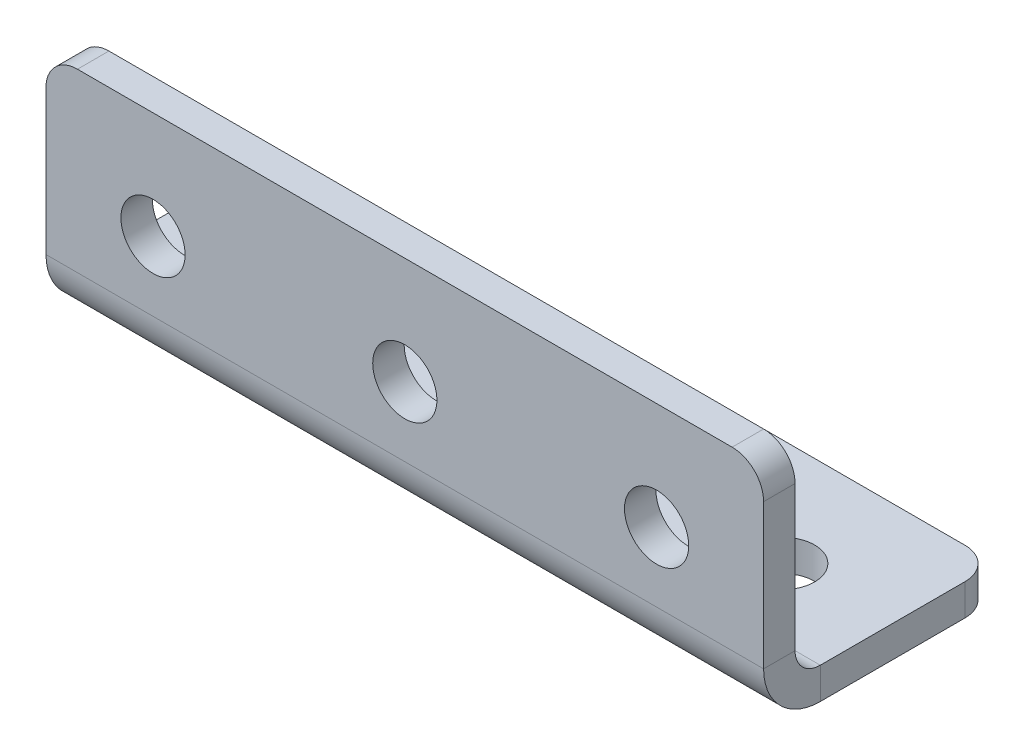
ISO-10303-21;
HEADER;
FILE_DESCRIPTION(('STEP AP214'),'2;1');
FILE_NAME('part.step','',(''),(''),'','','');
FILE_SCHEMA(('AUTOMOTIVE_DESIGN { 1 0 10303 214 1 1 1 1 }'));
ENDSEC;
DATA;
#1=APPLICATION_CONTEXT('core data for automotive mechanical design processes');
#2=APPLICATION_PROTOCOL_DEFINITION('international standard','automotive_design',2000,#1);
#3=PRODUCT_CONTEXT('',#1,'mechanical');
#4=PRODUCT('Part','Part','',(#3));
#5=PRODUCT_RELATED_PRODUCT_CATEGORY('part','',(#4));
#6=PRODUCT_DEFINITION_FORMATION('','',#4);
#7=PRODUCT_DEFINITION_CONTEXT('part definition',#1,'design');
#8=PRODUCT_DEFINITION('design','',#6,#7);
#9=PRODUCT_DEFINITION_SHAPE('','',#8);
#10=(LENGTH_UNIT() NAMED_UNIT(*) SI_UNIT(.MILLI.,.METRE.));
#11=(NAMED_UNIT(*) PLANE_ANGLE_UNIT() SI_UNIT($,.RADIAN.));
#12=(NAMED_UNIT(*) SI_UNIT($,.STERADIAN.) SOLID_ANGLE_UNIT());
#13=UNCERTAINTY_MEASURE_WITH_UNIT(LENGTH_MEASURE(1.E-05),#10,'distance_accuracy_value','');
#14=(GEOMETRIC_REPRESENTATION_CONTEXT(3) GLOBAL_UNCERTAINTY_ASSIGNED_CONTEXT((#13)) GLOBAL_UNIT_ASSIGNED_CONTEXT((#10,
#11,#12)) REPRESENTATION_CONTEXT('',''));
#15=CARTESIAN_POINT('',(0.,0.,0.));
#16=DIRECTION('',(0.,0.,1.));
#17=DIRECTION('',(1.,0.,0.));
#18=AXIS2_PLACEMENT_3D('',#15,#16,#17);
#19=CARTESIAN_POINT('',(57.,4.5,0.));
#20=DIRECTION('',(1.,0.,0.));
#21=DIRECTION('',(0.,0.,-1.));
#22=AXIS2_PLACEMENT_3D('',#19,#20,#21);
#23=PLANE('',#22);
#24=DIRECTION('',(0.,0.,-1.));
#25=VECTOR('',#24,1.);
#26=CARTESIAN_POINT('',(57.,4.5,0.));
#27=LINE('',#26,#25);
#28=CARTESIAN_POINT('',(57.,4.5,0.));
#29=VERTEX_POINT('',#28);
#30=CARTESIAN_POINT('',(57.,4.5,-2.5));
#31=VERTEX_POINT('',#30);
#32=EDGE_CURVE('E117',#29,#31,#27,.T.);
#33=ORIENTED_EDGE('',*,*,#32,.F.);
#34=CARTESIAN_POINT('',(57.,4.5,-4.5));
#35=DIRECTION('',(-1.,0.,0.));
#36=DIRECTION('',(0.,0.,1.));
#37=AXIS2_PLACEMENT_3D('',#34,#35,#36);
#38=CIRCLE('',#37,4.5);
#39=CARTESIAN_POINT('',(57.,0.,-4.5));
#40=VERTEX_POINT('',#39);
#41=EDGE_CURVE('E115',#29,#40,#38,.F.);
#42=ORIENTED_EDGE('',*,*,#41,.T.);
#43=DIRECTION('',(0.,-1.,0.));
#44=VECTOR('',#43,1.);
#45=CARTESIAN_POINT('',(57.,2.5,-4.5));
#46=LINE('',#45,#44);
#47=CARTESIAN_POINT('',(57.,2.5,-4.5));
#48=VERTEX_POINT('',#47);
#49=EDGE_CURVE('E109',#48,#40,#46,.T.);
#50=ORIENTED_EDGE('',*,*,#49,.F.);
#51=CARTESIAN_POINT('',(57.,4.5,-4.5));
#52=DIRECTION('',(1.,0.,0.));
#53=DIRECTION('',(0.,0.,-1.));
#54=AXIS2_PLACEMENT_3D('',#51,#52,#53);
#55=CIRCLE('',#54,2.);
#56=EDGE_CURVE('E113',#31,#48,#55,.T.);
#57=ORIENTED_EDGE('',*,*,#56,.F.);
#58=EDGE_LOOP('',(#33,#42,#50,#57));
#59=FACE_BOUND('',#58,.T.);
#60=ADVANCED_FACE('F16',(#59),#23,.T.);
#61=CARTESIAN_POINT('',(57.,2.5,-4.5));
#62=DIRECTION('',(1.,0.,0.));
#63=DIRECTION('',(0.,0.,-1.));
#64=AXIS2_PLACEMENT_3D('',#61,#62,#63);
#65=PLANE('',#64);
#66=DIRECTION('',(0.,1.,0.));
#67=VECTOR('',#66,1.);
#68=CARTESIAN_POINT('',(57.,0.,-2.5));
#69=LINE('',#68,#67);
#70=CARTESIAN_POINT('',(57.,16.,-2.5));
#71=VERTEX_POINT('',#70);
#72=EDGE_CURVE('E141',#71,#31,#69,.F.);
#73=ORIENTED_EDGE('',*,*,#72,.F.);
#74=DIRECTION('',(0.,0.,-1.));
#75=VECTOR('',#74,1.);
#76=CARTESIAN_POINT('',(57.,16.,-4.5));
#77=LINE('',#76,#75);
#78=CARTESIAN_POINT('',(57.,16.,0.));
#79=VERTEX_POINT('',#78);
#80=EDGE_CURVE('E194',#71,#79,#77,.F.);
#81=ORIENTED_EDGE('',*,*,#80,.T.);
#82=DIRECTION('',(0.,-1.,0.));
#83=VECTOR('',#82,1.);
#84=CARTESIAN_POINT('',(57.,0.,0.));
#85=LINE('',#84,#83);
#86=EDGE_CURVE('E143',#79,#29,#85,.T.);
#87=ORIENTED_EDGE('',*,*,#86,.T.);
#88=ORIENTED_EDGE('',*,*,#32,.T.);
#89=EDGE_LOOP('',(#73,#81,#87,#88));
#90=FACE_BOUND('',#89,.T.);
#91=ADVANCED_FACE('F245',(#90),#65,.T.);
#92=CARTESIAN_POINT('',(0.,0.,-4.5));
#93=DIRECTION('',(-1.,0.,0.));
#94=DIRECTION('',(0.,0.,1.));
#95=AXIS2_PLACEMENT_3D('',#92,#93,#94);
#96=PLANE('',#95);
#97=DIRECTION('',(0.,1.,0.));
#98=VECTOR('',#97,1.);
#99=CARTESIAN_POINT('',(0.,0.,-4.5));
#100=LINE('',#99,#98);
#101=CARTESIAN_POINT('',(0.,0.,-4.5));
#102=VERTEX_POINT('',#101);
#103=CARTESIAN_POINT('',(0.,2.5,-4.5));
#104=VERTEX_POINT('',#103);
#105=EDGE_CURVE('E118',#102,#104,#100,.T.);
#106=ORIENTED_EDGE('',*,*,#105,.F.);
#107=CARTESIAN_POINT('',(0.,4.5,-4.5));
#108=DIRECTION('',(-1.,0.,0.));
#109=DIRECTION('',(0.,0.,1.));
#110=AXIS2_PLACEMENT_3D('',#107,#108,#109);
#111=CIRCLE('',#110,4.5);
#112=CARTESIAN_POINT('',(0.,4.5,0.));
#113=VERTEX_POINT('',#112);
#114=EDGE_CURVE('E161',#113,#102,#111,.F.);
#115=ORIENTED_EDGE('',*,*,#114,.F.);
#116=DIRECTION('',(0.,0.,1.));
#117=VECTOR('',#116,1.);
#118=CARTESIAN_POINT('',(0.,4.5,-2.5));
#119=LINE('',#118,#117);
#120=CARTESIAN_POINT('',(0.,4.5,-2.5));
#121=VERTEX_POINT('',#120);
#122=EDGE_CURVE('E179',#121,#113,#119,.T.);
#123=ORIENTED_EDGE('',*,*,#122,.F.);
#124=CARTESIAN_POINT('',(0.,4.5,-4.5));
#125=DIRECTION('',(1.,0.,0.));
#126=DIRECTION('',(0.,0.,-1.));
#127=AXIS2_PLACEMENT_3D('',#124,#125,#126);
#128=CIRCLE('',#127,2.);
#129=EDGE_CURVE('E155',#121,#104,#128,.T.);
#130=ORIENTED_EDGE('',*,*,#129,.T.);
#131=EDGE_LOOP('',(#106,#115,#123,#130));
#132=FACE_BOUND('',#131,.T.);
#133=ADVANCED_FACE('F250',(#132),#96,.T.);
#134=CARTESIAN_POINT('',(0.,4.5,-2.5));
#135=DIRECTION('',(-1.,0.,0.));
#136=DIRECTION('',(0.,0.,1.));
#137=AXIS2_PLACEMENT_3D('',#134,#135,#136);
#138=PLANE('',#137);
#139=DIRECTION('',(0.,0.,-1.));
#140=VECTOR('',#139,1.);
#141=CARTESIAN_POINT('',(0.,2.5,0.));
#142=LINE('',#141,#140);
#143=CARTESIAN_POINT('',(0.,2.5,-16.));
#144=VERTEX_POINT('',#143);
#145=EDGE_CURVE('E128',#104,#144,#142,.T.);
#146=ORIENTED_EDGE('',*,*,#145,.T.);
#147=DIRECTION('',(0.,-1.,0.));
#148=VECTOR('',#147,1.);
#149=CARTESIAN_POINT('',(0.,4.5,-16.));
#150=LINE('',#149,#148);
#151=CARTESIAN_POINT('',(0.,0.,-16.));
#152=VERTEX_POINT('',#151);
#153=EDGE_CURVE('E203',#144,#152,#150,.T.);
#154=ORIENTED_EDGE('',*,*,#153,.T.);
#155=DIRECTION('',(0.,0.,-1.));
#156=VECTOR('',#155,1.);
#157=CARTESIAN_POINT('',(0.,0.,0.));
#158=LINE('',#157,#156);
#159=EDGE_CURVE('E150',#102,#152,#158,.T.);
#160=ORIENTED_EDGE('',*,*,#159,.F.);
#161=ORIENTED_EDGE('',*,*,#105,.T.);
#162=EDGE_LOOP('',(#146,#154,#160,#161));
#163=FACE_BOUND('',#162,.T.);
#164=ADVANCED_FACE('F285',(#163),#138,.T.);
#165=CARTESIAN_POINT('',(57.,0.,0.));
#166=DIRECTION('',(0.,1.,0.));
#167=DIRECTION('',(0.,0.,1.));
#168=AXIS2_PLACEMENT_3D('',#165,#166,#167);
#169=PLANE('',#168);
#170=CARTESIAN_POINT('',(48.5,0.,-10.));
#171=DIRECTION('',(0.,1.,0.));
#172=DIRECTION('',(0.,0.,1.));
#173=AXIS2_PLACEMENT_3D('',#170,#171,#172);
#174=CIRCLE('',#173,2.55);
#175=CARTESIAN_POINT('',(48.5,0.,-7.45));
#176=VERTEX_POINT('',#175);
#177=EDGE_CURVE('E314',#176,#176,#174,.T.);
#178=ORIENTED_EDGE('',*,*,#177,.T.);
#179=EDGE_LOOP('',(#178));
#180=FACE_BOUND('',#179,.T.);
#181=CARTESIAN_POINT('',(28.5,0.,-10.));
#182=DIRECTION('',(0.,1.,0.));
#183=DIRECTION('',(0.,0.,1.));
#184=AXIS2_PLACEMENT_3D('',#181,#182,#183);
#185=CIRCLE('',#184,2.55);
#186=CARTESIAN_POINT('',(28.5,0.,-7.45));
#187=VERTEX_POINT('',#186);
#188=EDGE_CURVE('E310',#187,#187,#185,.T.);
#189=ORIENTED_EDGE('',*,*,#188,.T.);
#190=EDGE_LOOP('',(#189));
#191=FACE_BOUND('',#190,.T.);
#192=CARTESIAN_POINT('',(8.5,0.,-10.));
#193=DIRECTION('',(0.,1.,0.));
#194=DIRECTION('',(0.,0.,1.));
#195=AXIS2_PLACEMENT_3D('',#192,#193,#194);
#196=CIRCLE('',#195,2.55);
#197=CARTESIAN_POINT('',(8.5,0.,-7.45));
#198=VERTEX_POINT('',#197);
#199=EDGE_CURVE('E296',#198,#198,#196,.T.);
#200=ORIENTED_EDGE('',*,*,#199,.T.);
#201=EDGE_LOOP('',(#200));
#202=FACE_BOUND('',#201,.T.);
#203=ORIENTED_EDGE('',*,*,#159,.T.);
#204=CARTESIAN_POINT('',(2.5,0.,-16.));
#205=DIRECTION('',(0.,1.,0.));
#206=DIRECTION('',(0.,0.,1.));
#207=AXIS2_PLACEMENT_3D('',#204,#205,#206);
#208=CIRCLE('',#207,2.5);
#209=CARTESIAN_POINT('',(2.50000000000002,0.,-18.5));
#210=VERTEX_POINT('',#209);
#211=EDGE_CURVE('E208',#152,#210,#208,.F.);
#212=ORIENTED_EDGE('',*,*,#211,.T.);
#213=DIRECTION('',(-1.,0.,0.));
#214=VECTOR('',#213,1.);
#215=CARTESIAN_POINT('',(57.,0.,-18.5));
#216=LINE('',#215,#214);
#217=CARTESIAN_POINT('',(54.5,0.,-18.5));
#218=VERTEX_POINT('',#217);
#219=EDGE_CURVE('E177',#218,#210,#216,.T.);
#220=ORIENTED_EDGE('',*,*,#219,.F.);
#221=CARTESIAN_POINT('',(54.5,0.,-16.));
#222=DIRECTION('',(0.,1.,0.));
#223=DIRECTION('',(0.,0.,1.));
#224=AXIS2_PLACEMENT_3D('',#221,#222,#223);
#225=CIRCLE('',#224,2.5);
#226=CARTESIAN_POINT('',(57.,0.,-16.));
#227=VERTEX_POINT('',#226);
#228=EDGE_CURVE('E206',#218,#227,#225,.F.);
#229=ORIENTED_EDGE('',*,*,#228,.T.);
#230=DIRECTION('',(0.,0.,-1.));
#231=VECTOR('',#230,1.);
#232=CARTESIAN_POINT('',(57.,0.,0.));
#233=LINE('',#232,#231);
#234=EDGE_CURVE('E136',#40,#227,#233,.T.);
#235=ORIENTED_EDGE('',*,*,#234,.F.);
#236=DIRECTION('',(-1.,0.,0.));
#237=VECTOR('',#236,1.);
#238=CARTESIAN_POINT('',(57.,0.,-4.5));
#239=LINE('',#238,#237);
#240=EDGE_CURVE('E149',#40,#102,#239,.T.);
#241=ORIENTED_EDGE('',*,*,#240,.T.);
#242=EDGE_LOOP('',(#203,#212,#220,#229,#235,#241));
#243=FACE_BOUND('',#242,.T.);
#244=ADVANCED_FACE('F280',(#180,#191,#202,#243),#169,.F.);
#245=CARTESIAN_POINT('',(57.,2.5,-18.5));
#246=DIRECTION('',(0.,0.,-1.));
#247=DIRECTION('',(-1.,0.,0.));
#248=AXIS2_PLACEMENT_3D('',#245,#246,#247);
#249=PLANE('',#248);
#250=ORIENTED_EDGE('',*,*,#219,.T.);
#251=DIRECTION('',(0.,-1.,0.));
#252=VECTOR('',#251,1.);
#253=CARTESIAN_POINT('',(2.5,2.5,-18.5));
#254=LINE('',#253,#252);
#255=CARTESIAN_POINT('',(2.50000000000002,2.5,-18.5));
#256=VERTEX_POINT('',#255);
#257=EDGE_CURVE('E39',#210,#256,#254,.F.);
#258=ORIENTED_EDGE('',*,*,#257,.T.);
#259=DIRECTION('',(-1.,0.,0.));
#260=VECTOR('',#259,1.);
#261=CARTESIAN_POINT('',(57.,2.5,-18.5));
#262=LINE('',#261,#260);
#263=CARTESIAN_POINT('',(54.5,2.5,-18.5));
#264=VERTEX_POINT('',#263);
#265=EDGE_CURVE('E132',#264,#256,#262,.T.);
#266=ORIENTED_EDGE('',*,*,#265,.F.);
#267=DIRECTION('',(0.,-1.,0.));
#268=VECTOR('',#267,1.);
#269=CARTESIAN_POINT('',(54.5,2.5,-18.5));
#270=LINE('',#269,#268);
#271=EDGE_CURVE('E210',#264,#218,#270,.T.);
#272=ORIENTED_EDGE('',*,*,#271,.T.);
#273=EDGE_LOOP('',(#250,#258,#266,#272));
#274=FACE_BOUND('',#273,.T.);
#275=ADVANCED_FACE('F277',(#274),#249,.T.);
#276=CARTESIAN_POINT('',(57.,2.5,0.));
#277=DIRECTION('',(0.,1.,0.));
#278=DIRECTION('',(0.,0.,1.));
#279=AXIS2_PLACEMENT_3D('',#276,#277,#278);
#280=PLANE('',#279);
#281=CARTESIAN_POINT('',(48.5,2.5,-10.));
#282=DIRECTION('',(0.,1.,0.));
#283=DIRECTION('',(0.,0.,1.));
#284=AXIS2_PLACEMENT_3D('',#281,#282,#283);
#285=CIRCLE('',#284,2.55);
#286=CARTESIAN_POINT('',(48.5,2.5,-7.45));
#287=VERTEX_POINT('',#286);
#288=EDGE_CURVE('E317',#287,#287,#285,.T.);
#289=ORIENTED_EDGE('',*,*,#288,.F.);
#290=EDGE_LOOP('',(#289));
#291=FACE_BOUND('',#290,.T.);
#292=CARTESIAN_POINT('',(28.5,2.5,-10.));
#293=DIRECTION('',(0.,1.,0.));
#294=DIRECTION('',(0.,0.,1.));
#295=AXIS2_PLACEMENT_3D('',#292,#293,#294);
#296=CIRCLE('',#295,2.55);
#297=CARTESIAN_POINT('',(28.5,2.5,-7.45));
#298=VERTEX_POINT('',#297);
#299=EDGE_CURVE('E311',#298,#298,#296,.T.);
#300=ORIENTED_EDGE('',*,*,#299,.F.);
#301=EDGE_LOOP('',(#300));
#302=FACE_BOUND('',#301,.T.);
#303=CARTESIAN_POINT('',(8.5,2.5,-10.));
#304=DIRECTION('',(0.,1.,0.));
#305=DIRECTION('',(0.,0.,1.));
#306=AXIS2_PLACEMENT_3D('',#303,#304,#305);
#307=CIRCLE('',#306,2.55);
#308=CARTESIAN_POINT('',(8.5,2.5,-7.45));
#309=VERTEX_POINT('',#308);
#310=EDGE_CURVE('E299',#309,#309,#307,.T.);
#311=ORIENTED_EDGE('',*,*,#310,.F.);
#312=EDGE_LOOP('',(#311));
#313=FACE_BOUND('',#312,.T.);
#314=ORIENTED_EDGE('',*,*,#265,.T.);
#315=CARTESIAN_POINT('',(2.5,2.5,-16.));
#316=DIRECTION('',(0.,1.,0.));
#317=DIRECTION('',(0.,0.,1.));
#318=AXIS2_PLACEMENT_3D('',#315,#316,#317);
#319=CIRCLE('',#318,2.5);
#320=EDGE_CURVE('E216',#256,#144,#319,.T.);
#321=ORIENTED_EDGE('',*,*,#320,.T.);
#322=ORIENTED_EDGE('',*,*,#145,.F.);
#323=DIRECTION('',(-1.,0.,0.));
#324=VECTOR('',#323,1.);
#325=CARTESIAN_POINT('',(57.,2.5,-4.5));
#326=LINE('',#325,#324);
#327=EDGE_CURVE('E123',#48,#104,#326,.T.);
#328=ORIENTED_EDGE('',*,*,#327,.F.);
#329=DIRECTION('',(0.,0.,-1.));
#330=VECTOR('',#329,1.);
#331=CARTESIAN_POINT('',(57.,2.5,0.));
#332=LINE('',#331,#330);
#333=CARTESIAN_POINT('',(57.,2.5,-16.));
#334=VERTEX_POINT('',#333);
#335=EDGE_CURVE('E125',#48,#334,#332,.T.);
#336=ORIENTED_EDGE('',*,*,#335,.T.);
#337=CARTESIAN_POINT('',(54.5,2.5,-16.));
#338=DIRECTION('',(0.,1.,0.));
#339=DIRECTION('',(0.,0.,1.));
#340=AXIS2_PLACEMENT_3D('',#337,#338,#339);
#341=CIRCLE('',#340,2.5);
#342=EDGE_CURVE('E214',#334,#264,#341,.T.);
#343=ORIENTED_EDGE('',*,*,#342,.T.);
#344=EDGE_LOOP('',(#314,#321,#322,#328,#336,#343));
#345=FACE_BOUND('',#344,.T.);
#346=ADVANCED_FACE('F124',(#291,#302,#313,#345),#280,.T.);
#347=CARTESIAN_POINT('',(57.,4.5,-4.5));
#348=DIRECTION('',(-1.,0.,0.));
#349=DIRECTION('',(0.,0.,1.));
#350=AXIS2_PLACEMENT_3D('',#347,#348,#349);
#351=CYLINDRICAL_SURFACE('',#350,2.);
#352=ORIENTED_EDGE('',*,*,#129,.F.);
#353=DIRECTION('',(-1.,0.,0.));
#354=VECTOR('',#353,1.);
#355=CARTESIAN_POINT('',(57.,4.5,-2.5));
#356=LINE('',#355,#354);
#357=EDGE_CURVE('E133',#31,#121,#356,.T.);
#358=ORIENTED_EDGE('',*,*,#357,.F.);
#359=ORIENTED_EDGE('',*,*,#56,.T.);
#360=ORIENTED_EDGE('',*,*,#327,.T.);
#361=EDGE_LOOP('',(#352,#358,#359,#360));
#362=FACE_BOUND('',#361,.T.);
#363=ADVANCED_FACE('F139',(#362),#351,.F.);
#364=CARTESIAN_POINT('',(57.,0.,-2.5));
#365=DIRECTION('',(0.,0.,-1.));
#366=DIRECTION('',(-1.,0.,0.));
#367=AXIS2_PLACEMENT_3D('',#364,#365,#366);
#368=PLANE('',#367);
#369=CARTESIAN_POINT('',(28.5,10.,-2.5));
#370=DIRECTION('',(0.,0.,-1.));
#371=DIRECTION('',(-1.,0.,0.));
#372=AXIS2_PLACEMENT_3D('',#369,#370,#371);
#373=CIRCLE('',#372,2.55);
#374=CARTESIAN_POINT('',(25.95,10.,-2.5));
#375=VERTEX_POINT('',#374);
#376=EDGE_CURVE('E302',#375,#375,#373,.T.);
#377=ORIENTED_EDGE('',*,*,#376,.F.);
#378=EDGE_LOOP('',(#377));
#379=FACE_BOUND('',#378,.T.);
#380=CARTESIAN_POINT('',(8.5,10.,-2.5));
#381=DIRECTION('',(0.,0.,-1.));
#382=DIRECTION('',(-1.,0.,0.));
#383=AXIS2_PLACEMENT_3D('',#380,#381,#382);
#384=CIRCLE('',#383,2.55);
#385=CARTESIAN_POINT('',(5.95,10.,-2.5));
#386=VERTEX_POINT('',#385);
#387=EDGE_CURVE('E293',#386,#386,#384,.T.);
#388=ORIENTED_EDGE('',*,*,#387,.F.);
#389=EDGE_LOOP('',(#388));
#390=FACE_BOUND('',#389,.T.);
#391=DIRECTION('',(-1.,0.,0.));
#392=VECTOR('',#391,1.);
#393=CARTESIAN_POINT('',(57.,18.5,-2.5));
#394=LINE('',#393,#392);
#395=CARTESIAN_POINT('',(54.5,18.5,-2.5));
#396=VERTEX_POINT('',#395);
#397=CARTESIAN_POINT('',(2.50000000000002,18.5,-2.5));
#398=VERTEX_POINT('',#397);
#399=EDGE_CURVE('E172',#396,#398,#394,.T.);
#400=ORIENTED_EDGE('',*,*,#399,.F.);
#401=CARTESIAN_POINT('',(54.5,16.,-2.5));
#402=DIRECTION('',(0.,0.,-1.));
#403=DIRECTION('',(-1.,0.,0.));
#404=AXIS2_PLACEMENT_3D('',#401,#402,#403);
#405=CIRCLE('',#404,2.5);
#406=EDGE_CURVE('E192',#396,#71,#405,.T.);
#407=ORIENTED_EDGE('',*,*,#406,.T.);
#408=ORIENTED_EDGE('',*,*,#72,.T.);
#409=ORIENTED_EDGE('',*,*,#357,.T.);
#410=DIRECTION('',(0.,1.,0.));
#411=VECTOR('',#410,1.);
#412=CARTESIAN_POINT('',(0.,0.,-2.5));
#413=LINE('',#412,#411);
#414=CARTESIAN_POINT('',(0.,16.,-2.5));
#415=VERTEX_POINT('',#414);
#416=EDGE_CURVE('E157',#415,#121,#413,.F.);
#417=ORIENTED_EDGE('',*,*,#416,.F.);
#418=CARTESIAN_POINT('',(2.5,16.,-2.5));
#419=DIRECTION('',(0.,0.,-1.));
#420=DIRECTION('',(-1.,0.,0.));
#421=AXIS2_PLACEMENT_3D('',#418,#419,#420);
#422=CIRCLE('',#421,2.5);
#423=EDGE_CURVE('E190',#415,#398,#422,.T.);
#424=ORIENTED_EDGE('',*,*,#423,.T.);
#425=EDGE_LOOP('',(#400,#407,#408,#409,#417,#424));
#426=FACE_BOUND('',#425,.T.);
#427=CARTESIAN_POINT('',(48.5,10.,-2.5));
#428=DIRECTION('',(0.,0.,-1.));
#429=DIRECTION('',(-1.,0.,0.));
#430=AXIS2_PLACEMENT_3D('',#427,#428,#429);
#431=CIRCLE('',#430,2.55);
#432=CARTESIAN_POINT('',(45.95,10.,-2.5));
#433=VERTEX_POINT('',#432);
#434=EDGE_CURVE('E10',#433,#433,#431,.T.);
#435=ORIENTED_EDGE('',*,*,#434,.F.);
#436=EDGE_LOOP('',(#435));
#437=FACE_BOUND('',#436,.T.);
#438=ADVANCED_FACE('F229',(#379,#390,#426,#437),#368,.T.);
#439=CARTESIAN_POINT('',(57.,18.5,0.));
#440=DIRECTION('',(0.,1.,0.));
#441=DIRECTION('',(0.,0.,1.));
#442=AXIS2_PLACEMENT_3D('',#439,#440,#441);
#443=PLANE('',#442);
#444=DIRECTION('',(-1.,0.,0.));
#445=VECTOR('',#444,1.);
#446=CARTESIAN_POINT('',(57.,18.5,0.));
#447=LINE('',#446,#445);
#448=CARTESIAN_POINT('',(54.5,18.5,0.));
#449=VERTEX_POINT('',#448);
#450=CARTESIAN_POINT('',(2.50000000000002,18.5,0.));
#451=VERTEX_POINT('',#450);
#452=EDGE_CURVE('E169',#449,#451,#447,.T.);
#453=ORIENTED_EDGE('',*,*,#452,.F.);
#454=DIRECTION('',(0.,0.,-1.));
#455=VECTOR('',#454,1.);
#456=CARTESIAN_POINT('',(54.5,18.5,0.));
#457=LINE('',#456,#455);
#458=EDGE_CURVE('E187',#449,#396,#457,.T.);
#459=ORIENTED_EDGE('',*,*,#458,.T.);
#460=ORIENTED_EDGE('',*,*,#399,.T.);
#461=DIRECTION('',(0.,0.,-1.));
#462=VECTOR('',#461,1.);
#463=CARTESIAN_POINT('',(2.5,18.5,0.));
#464=LINE('',#463,#462);
#465=EDGE_CURVE('E185',#398,#451,#464,.F.);
#466=ORIENTED_EDGE('',*,*,#465,.T.);
#467=EDGE_LOOP('',(#453,#459,#460,#466));
#468=FACE_BOUND('',#467,.T.);
#469=ADVANCED_FACE('F231',(#468),#443,.T.);
#470=CARTESIAN_POINT('',(57.,0.,0.));
#471=DIRECTION('',(0.,0.,-1.));
#472=DIRECTION('',(-1.,0.,0.));
#473=AXIS2_PLACEMENT_3D('',#470,#471,#472);
#474=PLANE('',#473);
#475=CARTESIAN_POINT('',(28.5,10.,0.));
#476=DIRECTION('',(0.,0.,-1.));
#477=DIRECTION('',(-1.,0.,0.));
#478=AXIS2_PLACEMENT_3D('',#475,#476,#477);
#479=CIRCLE('',#478,2.55);
#480=CARTESIAN_POINT('',(25.95,10.,0.));
#481=VERTEX_POINT('',#480);
#482=EDGE_CURVE('E307',#481,#481,#479,.T.);
#483=ORIENTED_EDGE('',*,*,#482,.T.);
#484=EDGE_LOOP('',(#483));
#485=FACE_BOUND('',#484,.T.);
#486=CARTESIAN_POINT('',(8.5,10.,0.));
#487=DIRECTION('',(0.,0.,-1.));
#488=DIRECTION('',(-1.,0.,0.));
#489=AXIS2_PLACEMENT_3D('',#486,#487,#488);
#490=CIRCLE('',#489,2.55);
#491=CARTESIAN_POINT('',(5.95,10.,0.));
#492=VERTEX_POINT('',#491);
#493=EDGE_CURVE('E153',#492,#492,#490,.T.);
#494=ORIENTED_EDGE('',*,*,#493,.T.);
#495=EDGE_LOOP('',(#494));
#496=FACE_BOUND('',#495,.T.);
#497=ORIENTED_EDGE('',*,*,#86,.F.);
#498=CARTESIAN_POINT('',(54.5,16.,0.));
#499=DIRECTION('',(0.,0.,-1.));
#500=DIRECTION('',(-1.,0.,0.));
#501=AXIS2_PLACEMENT_3D('',#498,#499,#500);
#502=CIRCLE('',#501,2.5);
#503=EDGE_CURVE('E198',#79,#449,#502,.F.);
#504=ORIENTED_EDGE('',*,*,#503,.T.);
#505=ORIENTED_EDGE('',*,*,#452,.T.);
#506=CARTESIAN_POINT('',(2.5,16.,0.));
#507=DIRECTION('',(0.,0.,-1.));
#508=DIRECTION('',(-1.,0.,0.));
#509=AXIS2_PLACEMENT_3D('',#506,#507,#508);
#510=CIRCLE('',#509,2.5);
#511=CARTESIAN_POINT('',(0.,16.,0.));
#512=VERTEX_POINT('',#511);
#513=EDGE_CURVE('E196',#451,#512,#510,.F.);
#514=ORIENTED_EDGE('',*,*,#513,.T.);
#515=DIRECTION('',(0.,-1.,0.));
#516=VECTOR('',#515,1.);
#517=CARTESIAN_POINT('',(0.,0.,0.));
#518=LINE('',#517,#516);
#519=EDGE_CURVE('E159',#512,#113,#518,.T.);
#520=ORIENTED_EDGE('',*,*,#519,.T.);
#521=DIRECTION('',(-1.,0.,0.));
#522=VECTOR('',#521,1.);
#523=CARTESIAN_POINT('',(57.,4.5,0.));
#524=LINE('',#523,#522);
#525=EDGE_CURVE('E166',#29,#113,#524,.T.);
#526=ORIENTED_EDGE('',*,*,#525,.F.);
#527=EDGE_LOOP('',(#497,#504,#505,#514,#520,#526));
#528=FACE_BOUND('',#527,.T.);
#529=CARTESIAN_POINT('',(48.5,10.,0.));
#530=DIRECTION('',(0.,0.,-1.));
#531=DIRECTION('',(-1.,0.,0.));
#532=AXIS2_PLACEMENT_3D('',#529,#530,#531);
#533=CIRCLE('',#532,2.55);
#534=CARTESIAN_POINT('',(45.95,10.,0.));
#535=VERTEX_POINT('',#534);
#536=EDGE_CURVE('E24',#535,#535,#533,.T.);
#537=ORIENTED_EDGE('',*,*,#536,.T.);
#538=EDGE_LOOP('',(#537));
#539=FACE_BOUND('',#538,.T.);
#540=ADVANCED_FACE('F221',(#485,#496,#528,#539),#474,.F.);
#541=CARTESIAN_POINT('',(57.,4.5,-4.5));
#542=DIRECTION('',(-1.,0.,0.));
#543=DIRECTION('',(0.,0.,1.));
#544=AXIS2_PLACEMENT_3D('',#541,#542,#543);
#545=CYLINDRICAL_SURFACE('',#544,4.5);
#546=ORIENTED_EDGE('',*,*,#114,.T.);
#547=ORIENTED_EDGE('',*,*,#240,.F.);
#548=ORIENTED_EDGE('',*,*,#41,.F.);
#549=ORIENTED_EDGE('',*,*,#525,.T.);
#550=EDGE_LOOP('',(#546,#547,#548,#549));
#551=FACE_BOUND('',#550,.T.);
#552=ADVANCED_FACE('F290',(#551),#545,.T.);
#553=CARTESIAN_POINT('',(57.,4.5,-4.5));
#554=DIRECTION('',(1.,0.,0.));
#555=DIRECTION('',(0.,0.,-1.));
#556=AXIS2_PLACEMENT_3D('',#553,#554,#555);
#557=PLANE('',#556);
#558=ORIENTED_EDGE('',*,*,#234,.T.);
#559=DIRECTION('',(0.,-1.,0.));
#560=VECTOR('',#559,1.);
#561=CARTESIAN_POINT('',(57.,4.5,-16.));
#562=LINE('',#561,#560);
#563=EDGE_CURVE('E31',#227,#334,#562,.F.);
#564=ORIENTED_EDGE('',*,*,#563,.T.);
#565=ORIENTED_EDGE('',*,*,#335,.F.);
#566=ORIENTED_EDGE('',*,*,#49,.T.);
#567=EDGE_LOOP('',(#558,#564,#565,#566));
#568=FACE_BOUND('',#567,.T.);
#569=ADVANCED_FACE('F135',(#568),#557,.T.);
#570=CARTESIAN_POINT('',(0.,4.5,-4.5));
#571=DIRECTION('',(1.,0.,0.));
#572=DIRECTION('',(0.,0.,-1.));
#573=AXIS2_PLACEMENT_3D('',#570,#571,#572);
#574=PLANE('',#573);
#575=ORIENTED_EDGE('',*,*,#519,.F.);
#576=DIRECTION('',(0.,0.,-1.));
#577=VECTOR('',#576,1.);
#578=CARTESIAN_POINT('',(0.,16.,-2.5));
#579=LINE('',#578,#577);
#580=EDGE_CURVE('E200',#512,#415,#579,.T.);
#581=ORIENTED_EDGE('',*,*,#580,.T.);
#582=ORIENTED_EDGE('',*,*,#416,.T.);
#583=ORIENTED_EDGE('',*,*,#122,.T.);
#584=EDGE_LOOP('',(#575,#581,#582,#583));
#585=FACE_BOUND('',#584,.T.);
#586=ADVANCED_FACE('F345',(#585),#574,.F.);
#587=CARTESIAN_POINT('',(8.5,10.,0.));
#588=DIRECTION('',(0.,0.,-1.));
#589=DIRECTION('',(-1.,0.,0.));
#590=AXIS2_PLACEMENT_3D('',#587,#588,#589);
#591=CYLINDRICAL_SURFACE('',#590,2.55);
#592=ORIENTED_EDGE('',*,*,#493,.F.);
#593=EDGE_LOOP('',(#592));
#594=FACE_BOUND('',#593,.T.);
#595=ORIENTED_EDGE('',*,*,#387,.T.);
#596=EDGE_LOOP('',(#595));
#597=FACE_BOUND('',#596,.T.);
#598=ADVANCED_FACE('F339',(#594,#597),#591,.F.);
#599=CARTESIAN_POINT('',(8.5,0.,-10.));
#600=DIRECTION('',(0.,1.,0.));
#601=DIRECTION('',(0.,0.,1.));
#602=AXIS2_PLACEMENT_3D('',#599,#600,#601);
#603=CYLINDRICAL_SURFACE('',#602,2.55);
#604=ORIENTED_EDGE('',*,*,#199,.F.);
#605=EDGE_LOOP('',(#604));
#606=FACE_BOUND('',#605,.T.);
#607=ORIENTED_EDGE('',*,*,#310,.T.);
#608=EDGE_LOOP('',(#607));
#609=FACE_BOUND('',#608,.T.);
#610=ADVANCED_FACE('F259',(#606,#609),#603,.F.);
#611=CARTESIAN_POINT('',(54.5,16.,0.));
#612=DIRECTION('',(0.,0.,-1.));
#613=DIRECTION('',(-1.,0.,0.));
#614=AXIS2_PLACEMENT_3D('',#611,#612,#613);
#615=CYLINDRICAL_SURFACE('',#614,2.5);
#616=ORIENTED_EDGE('',*,*,#503,.F.);
#617=ORIENTED_EDGE('',*,*,#80,.F.);
#618=ORIENTED_EDGE('',*,*,#406,.F.);
#619=ORIENTED_EDGE('',*,*,#458,.F.);
#620=EDGE_LOOP('',(#616,#617,#618,#619));
#621=FACE_BOUND('',#620,.T.);
#622=ADVANCED_FACE('F255',(#621),#615,.T.);
#623=CARTESIAN_POINT('',(2.5,16.,-4.5));
#624=DIRECTION('',(0.,0.,1.));
#625=DIRECTION('',(1.,0.,0.));
#626=AXIS2_PLACEMENT_3D('',#623,#624,#625);
#627=CYLINDRICAL_SURFACE('',#626,2.5);
#628=ORIENTED_EDGE('',*,*,#513,.F.);
#629=ORIENTED_EDGE('',*,*,#465,.F.);
#630=ORIENTED_EDGE('',*,*,#423,.F.);
#631=ORIENTED_EDGE('',*,*,#580,.F.);
#632=EDGE_LOOP('',(#628,#629,#630,#631));
#633=FACE_BOUND('',#632,.T.);
#634=ADVANCED_FACE('F258',(#633),#627,.T.);
#635=CARTESIAN_POINT('',(2.5,4.5,-16.));
#636=DIRECTION('',(0.,-1.,0.));
#637=DIRECTION('',(0.,0.,-1.));
#638=AXIS2_PLACEMENT_3D('',#635,#636,#637);
#639=CYLINDRICAL_SURFACE('',#638,2.5);
#640=ORIENTED_EDGE('',*,*,#320,.F.);
#641=ORIENTED_EDGE('',*,*,#257,.F.);
#642=ORIENTED_EDGE('',*,*,#211,.F.);
#643=ORIENTED_EDGE('',*,*,#153,.F.);
#644=EDGE_LOOP('',(#640,#641,#642,#643));
#645=FACE_BOUND('',#644,.T.);
#646=ADVANCED_FACE('F263',(#645),#639,.T.);
#647=CARTESIAN_POINT('',(54.5,2.5,-16.));
#648=DIRECTION('',(0.,-1.,0.));
#649=DIRECTION('',(0.,0.,-1.));
#650=AXIS2_PLACEMENT_3D('',#647,#648,#649);
#651=CYLINDRICAL_SURFACE('',#650,2.5);
#652=ORIENTED_EDGE('',*,*,#342,.F.);
#653=ORIENTED_EDGE('',*,*,#563,.F.);
#654=ORIENTED_EDGE('',*,*,#228,.F.);
#655=ORIENTED_EDGE('',*,*,#271,.F.);
#656=EDGE_LOOP('',(#652,#653,#654,#655));
#657=FACE_BOUND('',#656,.T.);
#658=ADVANCED_FACE('F266',(#657),#651,.T.);
#659=CARTESIAN_POINT('',(28.5,10.,0.));
#660=DIRECTION('',(0.,0.,-1.));
#661=DIRECTION('',(-1.,0.,0.));
#662=AXIS2_PLACEMENT_3D('',#659,#660,#661);
#663=CYLINDRICAL_SURFACE('',#662,2.55);
#664=ORIENTED_EDGE('',*,*,#482,.F.);
#665=EDGE_LOOP('',(#664));
#666=FACE_BOUND('',#665,.T.);
#667=ORIENTED_EDGE('',*,*,#376,.T.);
#668=EDGE_LOOP('',(#667));
#669=FACE_BOUND('',#668,.T.);
#670=ADVANCED_FACE('F226',(#666,#669),#663,.F.);
#671=CARTESIAN_POINT('',(48.5,10.,0.));
#672=DIRECTION('',(0.,0.,-1.));
#673=DIRECTION('',(-1.,0.,0.));
#674=AXIS2_PLACEMENT_3D('',#671,#672,#673);
#675=CYLINDRICAL_SURFACE('',#674,2.55);
#676=ORIENTED_EDGE('',*,*,#536,.F.);
#677=EDGE_LOOP('',(#676));
#678=FACE_BOUND('',#677,.T.);
#679=ORIENTED_EDGE('',*,*,#434,.T.);
#680=EDGE_LOOP('',(#679));
#681=FACE_BOUND('',#680,.T.);
#682=ADVANCED_FACE('F18',(#678,#681),#675,.F.);
#683=CARTESIAN_POINT('',(28.5,0.,-10.));
#684=DIRECTION('',(0.,1.,0.));
#685=DIRECTION('',(0.,0.,1.));
#686=AXIS2_PLACEMENT_3D('',#683,#684,#685);
#687=CYLINDRICAL_SURFACE('',#686,2.55);
#688=ORIENTED_EDGE('',*,*,#188,.F.);
#689=EDGE_LOOP('',(#688));
#690=FACE_BOUND('',#689,.T.);
#691=ORIENTED_EDGE('',*,*,#299,.T.);
#692=EDGE_LOOP('',(#691));
#693=FACE_BOUND('',#692,.T.);
#694=ADVANCED_FACE('F225',(#690,#693),#687,.F.);
#695=CARTESIAN_POINT('',(48.5,0.,-10.));
#696=DIRECTION('',(0.,1.,0.));
#697=DIRECTION('',(0.,0.,1.));
#698=AXIS2_PLACEMENT_3D('',#695,#696,#697);
#699=CYLINDRICAL_SURFACE('',#698,2.55);
#700=ORIENTED_EDGE('',*,*,#177,.F.);
#701=EDGE_LOOP('',(#700));
#702=FACE_BOUND('',#701,.T.);
#703=ORIENTED_EDGE('',*,*,#288,.T.);
#704=EDGE_LOOP('',(#703));
#705=FACE_BOUND('',#704,.T.);
#706=ADVANCED_FACE('F325',(#702,#705),#699,.F.);
#707=CLOSED_SHELL('',(#60,#91,#133,#164,#244,#275,#346,#363,#438,#469,#540,#552,#569,#586,#598,
#610,#622,#634,#646,#658,#670,#682,#694,#706));
#708=MANIFOLD_SOLID_BREP('B1',#707);
#709=ADVANCED_BREP_SHAPE_REPRESENTATION('',(#18,#708),#14);
#710=SHAPE_DEFINITION_REPRESENTATION(#9,#709);
ENDSEC;
END-ISO-10303-21;
